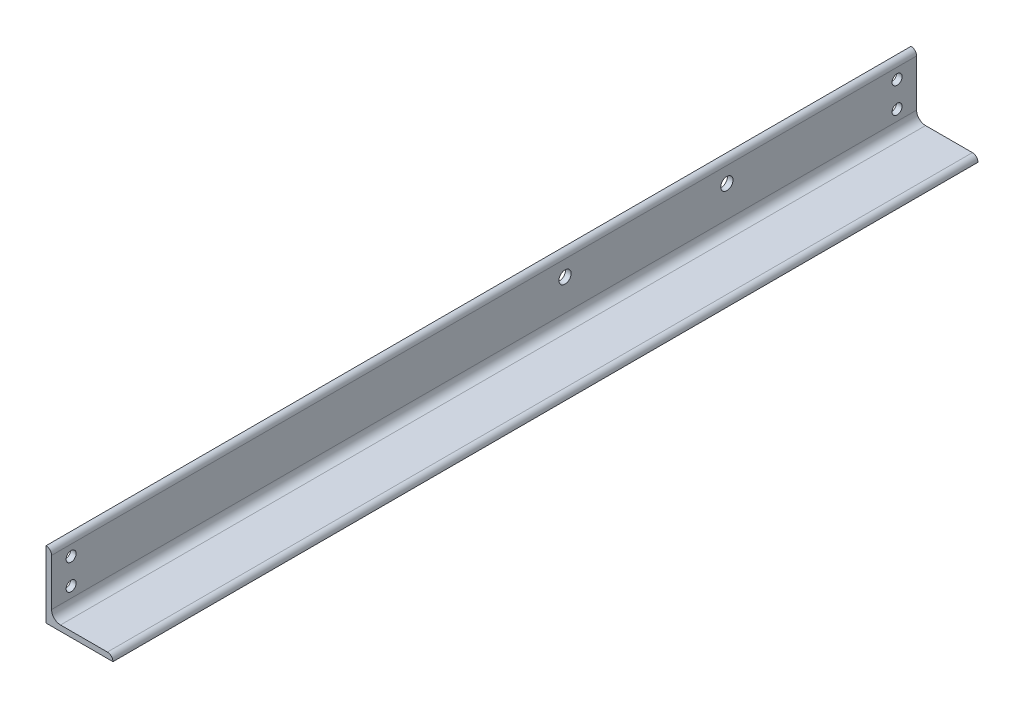
ISO-10303-21;
HEADER;
FILE_DESCRIPTION(('STEP AP214'),'2;1');
FILE_NAME('part.step','',(''),(''),'','','');
FILE_SCHEMA(('AUTOMOTIVE_DESIGN { 1 0 10303 214 1 1 1 1 }'));
ENDSEC;
DATA;
#1=APPLICATION_CONTEXT('core data for automotive mechanical design processes');
#2=APPLICATION_PROTOCOL_DEFINITION('international standard','automotive_design',2000,#1);
#3=PRODUCT_CONTEXT('',#1,'mechanical');
#4=PRODUCT('Part','Part','',(#3));
#5=PRODUCT_RELATED_PRODUCT_CATEGORY('part','',(#4));
#6=PRODUCT_DEFINITION_FORMATION('','',#4);
#7=PRODUCT_DEFINITION_CONTEXT('part definition',#1,'design');
#8=PRODUCT_DEFINITION('design','',#6,#7);
#9=PRODUCT_DEFINITION_SHAPE('','',#8);
#10=(LENGTH_UNIT() NAMED_UNIT(*) SI_UNIT(.MILLI.,.METRE.));
#11=(NAMED_UNIT(*) PLANE_ANGLE_UNIT() SI_UNIT($,.RADIAN.));
#12=(NAMED_UNIT(*) SI_UNIT($,.STERADIAN.) SOLID_ANGLE_UNIT());
#13=UNCERTAINTY_MEASURE_WITH_UNIT(LENGTH_MEASURE(1.E-05),#10,'distance_accuracy_value','');
#14=(GEOMETRIC_REPRESENTATION_CONTEXT(3) GLOBAL_UNCERTAINTY_ASSIGNED_CONTEXT((#13)) GLOBAL_UNIT_ASSIGNED_CONTEXT((#10,
#11,#12)) REPRESENTATION_CONTEXT('',''));
#15=CARTESIAN_POINT('',(0.,0.,0.));
#16=DIRECTION('',(0.,0.,1.));
#17=DIRECTION('',(1.,0.,0.));
#18=AXIS2_PLACEMENT_3D('',#15,#16,#17);
#19=CARTESIAN_POINT('',(59.9999999999999,1.11022302462516E-13,387.5));
#20=DIRECTION('',(0.,1.,0.));
#21=DIRECTION('',(-1.,0.,0.));
#22=AXIS2_PLACEMENT_3D('',#19,#20,#21);
#23=PLANE('',#22);
#24=DIRECTION('',(1.,0.,0.));
#25=VECTOR('',#24,1.);
#26=CARTESIAN_POINT('',(59.9999999999999,1.11022302462516E-13,-387.5));
#27=LINE('',#26,#25);
#28=CARTESIAN_POINT('',(0.,0.,-387.5));
#29=VERTEX_POINT('',#28);
#30=CARTESIAN_POINT('',(59.9999999999999,1.11022302462516E-13,-387.5));
#31=VERTEX_POINT('',#30);
#32=EDGE_CURVE('E116',#29,#31,#27,.T.);
#33=ORIENTED_EDGE('',*,*,#32,.T.);
#34=DIRECTION('',(0.,0.,-1.));
#35=VECTOR('',#34,1.);
#36=CARTESIAN_POINT('',(59.9999999999999,1.11022302462516E-13,387.5));
#37=LINE('',#36,#35);
#38=CARTESIAN_POINT('',(59.9999999999999,1.11022302462516E-13,387.5));
#39=VERTEX_POINT('',#38);
#40=EDGE_CURVE('E114',#39,#31,#37,.T.);
#41=ORIENTED_EDGE('',*,*,#40,.F.);
#42=DIRECTION('',(1.,0.,0.));
#43=VECTOR('',#42,1.);
#44=CARTESIAN_POINT('',(59.9999999999999,1.11022302462516E-13,387.5));
#45=LINE('',#44,#43);
#46=CARTESIAN_POINT('',(0.,0.,387.5));
#47=VERTEX_POINT('',#46);
#48=EDGE_CURVE('E101',#47,#39,#45,.T.);
#49=ORIENTED_EDGE('',*,*,#48,.F.);
#50=DIRECTION('',(0.,0.,-1.));
#51=VECTOR('',#50,1.);
#52=CARTESIAN_POINT('',(0.,0.,387.5));
#53=LINE('',#52,#51);
#54=EDGE_CURVE('E136',#47,#29,#53,.T.);
#55=ORIENTED_EDGE('',*,*,#54,.T.);
#56=EDGE_LOOP('',(#33,#41,#49,#55));
#57=FACE_BOUND('',#56,.T.);
#58=ADVANCED_FACE('F42',(#57),#23,.F.);
#59=CARTESIAN_POINT('',(13.,5.00000000000006,387.5));
#60=DIRECTION('',(0.,-1.,0.));
#61=DIRECTION('',(1.,0.,0.));
#62=AXIS2_PLACEMENT_3D('',#59,#60,#61);
#63=PLANE('',#62);
#64=DIRECTION('',(-1.,0.,0.));
#65=VECTOR('',#64,1.);
#66=CARTESIAN_POINT('',(13.,5.00000000000006,387.5));
#67=LINE('',#66,#65);
#68=CARTESIAN_POINT('',(55.,5.00000000000012,387.5));
#69=VERTEX_POINT('',#68);
#70=CARTESIAN_POINT('',(13.,5.00000000000006,387.5));
#71=VERTEX_POINT('',#70);
#72=EDGE_CURVE('E109',#69,#71,#67,.T.);
#73=ORIENTED_EDGE('',*,*,#72,.F.);
#74=DIRECTION('',(0.,0.,-1.));
#75=VECTOR('',#74,1.);
#76=CARTESIAN_POINT('',(55.,5.00000000000012,387.5));
#77=LINE('',#76,#75);
#78=CARTESIAN_POINT('',(55.,5.00000000000012,-387.5));
#79=VERTEX_POINT('',#78);
#80=EDGE_CURVE('E11',#69,#79,#77,.T.);
#81=ORIENTED_EDGE('',*,*,#80,.T.);
#82=DIRECTION('',(-1.,0.,0.));
#83=VECTOR('',#82,1.);
#84=CARTESIAN_POINT('',(13.,5.00000000000006,-387.5));
#85=LINE('',#84,#83);
#86=CARTESIAN_POINT('',(13.,5.00000000000006,-387.5));
#87=VERTEX_POINT('',#86);
#88=EDGE_CURVE('E143',#79,#87,#85,.T.);
#89=ORIENTED_EDGE('',*,*,#88,.T.);
#90=DIRECTION('',(0.,0.,-1.));
#91=VECTOR('',#90,1.);
#92=CARTESIAN_POINT('',(13.,5.00000000000006,387.5));
#93=LINE('',#92,#91);
#94=EDGE_CURVE('E119',#71,#87,#93,.T.);
#95=ORIENTED_EDGE('',*,*,#94,.F.);
#96=EDGE_LOOP('',(#73,#81,#89,#95));
#97=FACE_BOUND('',#96,.T.);
#98=ADVANCED_FACE('F219',(#97),#63,.F.);
#99=CARTESIAN_POINT('',(13.,13.0000000000001,387.5));
#100=DIRECTION('',(0.,0.,-1.));
#101=DIRECTION('',(-1.,0.,0.));
#102=AXIS2_PLACEMENT_3D('',#99,#100,#101);
#103=CYLINDRICAL_SURFACE('',#102,8.);
#104=CARTESIAN_POINT('',(13.,13.0000000000001,-387.5));
#105=DIRECTION('',(0.,0.,-1.));
#106=DIRECTION('',(-1.,0.,0.));
#107=AXIS2_PLACEMENT_3D('',#104,#105,#106);
#108=CIRCLE('',#107,8.);
#109=CARTESIAN_POINT('',(5.,13.0000000000001,-387.5));
#110=VERTEX_POINT('',#109);
#111=EDGE_CURVE('E141',#87,#110,#108,.T.);
#112=ORIENTED_EDGE('',*,*,#111,.T.);
#113=DIRECTION('',(0.,0.,-1.));
#114=VECTOR('',#113,1.);
#115=CARTESIAN_POINT('',(5.,13.0000000000001,387.5));
#116=LINE('',#115,#114);
#117=CARTESIAN_POINT('',(5.,13.0000000000001,387.5));
#118=VERTEX_POINT('',#117);
#119=EDGE_CURVE('E130',#118,#110,#116,.T.);
#120=ORIENTED_EDGE('',*,*,#119,.F.);
#121=CARTESIAN_POINT('',(13.,13.0000000000001,387.5));
#122=DIRECTION('',(0.,0.,-1.));
#123=DIRECTION('',(-1.,0.,0.));
#124=AXIS2_PLACEMENT_3D('',#121,#122,#123);
#125=CIRCLE('',#124,8.);
#126=EDGE_CURVE('E150',#71,#118,#125,.T.);
#127=ORIENTED_EDGE('',*,*,#126,.F.);
#128=ORIENTED_EDGE('',*,*,#94,.T.);
#129=EDGE_LOOP('',(#112,#120,#127,#128));
#130=FACE_BOUND('',#129,.T.);
#131=ADVANCED_FACE('F195',(#130),#103,.F.);
#132=CARTESIAN_POINT('',(5.,60.0000000000001,387.5));
#133=DIRECTION('',(-1.,0.,0.));
#134=DIRECTION('',(0.,-1.,0.));
#135=AXIS2_PLACEMENT_3D('',#132,#133,#134);
#136=PLANE('',#135);
#137=CARTESIAN_POINT('',(5.,22.5000000000001,370.));
#138=DIRECTION('',(1.,0.,0.));
#139=DIRECTION('',(0.,0.,-1.));
#140=AXIS2_PLACEMENT_3D('',#137,#138,#139);
#141=CIRCLE('',#140,4.5);
#142=CARTESIAN_POINT('',(5.,22.5000000000001,365.5));
#143=VERTEX_POINT('',#142);
#144=EDGE_CURVE('E185',#143,#143,#141,.T.);
#145=ORIENTED_EDGE('',*,*,#144,.F.);
#146=EDGE_LOOP('',(#145));
#147=FACE_BOUND('',#146,.T.);
#148=CARTESIAN_POINT('',(5.,45.5000000000001,370.));
#149=DIRECTION('',(1.,0.,0.));
#150=DIRECTION('',(0.,0.,-1.));
#151=AXIS2_PLACEMENT_3D('',#148,#149,#150);
#152=CIRCLE('',#151,4.5);
#153=CARTESIAN_POINT('',(5.,45.5000000000001,365.5));
#154=VERTEX_POINT('',#153);
#155=EDGE_CURVE('E179',#154,#154,#152,.T.);
#156=ORIENTED_EDGE('',*,*,#155,.F.);
#157=EDGE_LOOP('',(#156));
#158=FACE_BOUND('',#157,.T.);
#159=CARTESIAN_POINT('',(5.,22.5000000000001,-370.));
#160=DIRECTION('',(1.,0.,0.));
#161=DIRECTION('',(0.,0.,-1.));
#162=AXIS2_PLACEMENT_3D('',#159,#160,#161);
#163=CIRCLE('',#162,4.5);
#164=CARTESIAN_POINT('',(5.,22.5000000000001,-374.5));
#165=VERTEX_POINT('',#164);
#166=EDGE_CURVE('E173',#165,#165,#163,.T.);
#167=ORIENTED_EDGE('',*,*,#166,.F.);
#168=EDGE_LOOP('',(#167));
#169=FACE_BOUND('',#168,.T.);
#170=CARTESIAN_POINT('',(5.,45.5000000000001,-370.));
#171=DIRECTION('',(1.,0.,0.));
#172=DIRECTION('',(0.,0.,-1.));
#173=AXIS2_PLACEMENT_3D('',#170,#171,#172);
#174=CIRCLE('',#173,4.5);
#175=CARTESIAN_POINT('',(5.,45.5000000000001,-374.5));
#176=VERTEX_POINT('',#175);
#177=EDGE_CURVE('E167',#176,#176,#174,.T.);
#178=ORIENTED_EDGE('',*,*,#177,.F.);
#179=EDGE_LOOP('',(#178));
#180=FACE_BOUND('',#179,.T.);
#181=CARTESIAN_POINT('',(5.,41.0000000000001,-72.4999999999998));
#182=DIRECTION('',(1.,0.,0.));
#183=DIRECTION('',(0.,0.,-1.));
#184=AXIS2_PLACEMENT_3D('',#181,#182,#183);
#185=CIRCLE('',#184,5.5);
#186=CARTESIAN_POINT('',(5.,41.0000000000001,-77.9999999999998));
#187=VERTEX_POINT('',#186);
#188=EDGE_CURVE('E161',#187,#187,#185,.T.);
#189=ORIENTED_EDGE('',*,*,#188,.F.);
#190=EDGE_LOOP('',(#189));
#191=FACE_BOUND('',#190,.T.);
#192=CARTESIAN_POINT('',(5.,41.0000000000001,-217.5));
#193=DIRECTION('',(1.,0.,0.));
#194=DIRECTION('',(0.,0.,-1.));
#195=AXIS2_PLACEMENT_3D('',#192,#193,#194);
#196=CIRCLE('',#195,5.5);
#197=CARTESIAN_POINT('',(5.,41.0000000000001,-223.));
#198=VERTEX_POINT('',#197);
#199=EDGE_CURVE('E155',#198,#198,#196,.T.);
#200=ORIENTED_EDGE('',*,*,#199,.F.);
#201=EDGE_LOOP('',(#200));
#202=FACE_BOUND('',#201,.T.);
#203=DIRECTION('',(0.,1.,0.));
#204=VECTOR('',#203,1.);
#205=CARTESIAN_POINT('',(5.,60.0000000000001,-387.5));
#206=LINE('',#205,#204);
#207=CARTESIAN_POINT('',(5.,55.0000000000001,-387.5));
#208=VERTEX_POINT('',#207);
#209=EDGE_CURVE('E139',#110,#208,#206,.T.);
#210=ORIENTED_EDGE('',*,*,#209,.T.);
#211=DIRECTION('',(0.,0.,-1.));
#212=VECTOR('',#211,1.);
#213=CARTESIAN_POINT('',(5.,55.0000000000001,387.5));
#214=LINE('',#213,#212);
#215=CARTESIAN_POINT('',(5.,55.0000000000001,387.5));
#216=VERTEX_POINT('',#215);
#217=EDGE_CURVE('E65',#208,#216,#214,.F.);
#218=ORIENTED_EDGE('',*,*,#217,.T.);
#219=DIRECTION('',(0.,1.,0.));
#220=VECTOR('',#219,1.);
#221=CARTESIAN_POINT('',(5.,60.0000000000001,387.5));
#222=LINE('',#221,#220);
#223=EDGE_CURVE('E148',#118,#216,#222,.T.);
#224=ORIENTED_EDGE('',*,*,#223,.F.);
#225=ORIENTED_EDGE('',*,*,#119,.T.);
#226=EDGE_LOOP('',(#210,#218,#224,#225));
#227=FACE_BOUND('',#226,.T.);
#228=ADVANCED_FACE('F191',(#147,#158,#169,#180,#191,#202,#227),#136,.F.);
#229=CARTESIAN_POINT('',(0.,60.0000000000001,387.5));
#230=DIRECTION('',(1.,0.,0.));
#231=DIRECTION('',(0.,1.,0.));
#232=AXIS2_PLACEMENT_3D('',#229,#230,#231);
#233=PLANE('',#232);
#234=CARTESIAN_POINT('',(0.,22.5,370.));
#235=DIRECTION('',(1.,0.,0.));
#236=DIRECTION('',(0.,0.,-1.));
#237=AXIS2_PLACEMENT_3D('',#234,#235,#236);
#238=CIRCLE('',#237,4.5);
#239=CARTESIAN_POINT('',(0.,22.5,365.5));
#240=VERTEX_POINT('',#239);
#241=EDGE_CURVE('E182',#240,#240,#238,.T.);
#242=ORIENTED_EDGE('',*,*,#241,.T.);
#243=EDGE_LOOP('',(#242));
#244=FACE_BOUND('',#243,.T.);
#245=CARTESIAN_POINT('',(0.,45.5000000000001,370.));
#246=DIRECTION('',(1.,0.,0.));
#247=DIRECTION('',(0.,0.,-1.));
#248=AXIS2_PLACEMENT_3D('',#245,#246,#247);
#249=CIRCLE('',#248,4.5);
#250=CARTESIAN_POINT('',(0.,45.5000000000001,365.5));
#251=VERTEX_POINT('',#250);
#252=EDGE_CURVE('E176',#251,#251,#249,.T.);
#253=ORIENTED_EDGE('',*,*,#252,.T.);
#254=EDGE_LOOP('',(#253));
#255=FACE_BOUND('',#254,.T.);
#256=CARTESIAN_POINT('',(0.,22.5,-370.));
#257=DIRECTION('',(1.,0.,0.));
#258=DIRECTION('',(0.,0.,-1.));
#259=AXIS2_PLACEMENT_3D('',#256,#257,#258);
#260=CIRCLE('',#259,4.5);
#261=CARTESIAN_POINT('',(0.,22.5,-374.5));
#262=VERTEX_POINT('',#261);
#263=EDGE_CURVE('E170',#262,#262,#260,.T.);
#264=ORIENTED_EDGE('',*,*,#263,.T.);
#265=EDGE_LOOP('',(#264));
#266=FACE_BOUND('',#265,.T.);
#267=CARTESIAN_POINT('',(0.,45.5000000000001,-370.));
#268=DIRECTION('',(1.,0.,0.));
#269=DIRECTION('',(0.,0.,-1.));
#270=AXIS2_PLACEMENT_3D('',#267,#268,#269);
#271=CIRCLE('',#270,4.5);
#272=CARTESIAN_POINT('',(0.,45.5000000000001,-374.5));
#273=VERTEX_POINT('',#272);
#274=EDGE_CURVE('E164',#273,#273,#271,.T.);
#275=ORIENTED_EDGE('',*,*,#274,.T.);
#276=EDGE_LOOP('',(#275));
#277=FACE_BOUND('',#276,.T.);
#278=CARTESIAN_POINT('',(0.,41.0000000000001,-72.4999999999998));
#279=DIRECTION('',(1.,0.,0.));
#280=DIRECTION('',(0.,0.,-1.));
#281=AXIS2_PLACEMENT_3D('',#278,#279,#280);
#282=CIRCLE('',#281,5.5);
#283=CARTESIAN_POINT('',(0.,41.0000000000001,-77.9999999999998));
#284=VERTEX_POINT('',#283);
#285=EDGE_CURVE('E158',#284,#284,#282,.T.);
#286=ORIENTED_EDGE('',*,*,#285,.T.);
#287=EDGE_LOOP('',(#286));
#288=FACE_BOUND('',#287,.T.);
#289=CARTESIAN_POINT('',(0.,41.0000000000001,-217.5));
#290=DIRECTION('',(1.,0.,0.));
#291=DIRECTION('',(0.,0.,-1.));
#292=AXIS2_PLACEMENT_3D('',#289,#290,#291);
#293=CIRCLE('',#292,5.5);
#294=CARTESIAN_POINT('',(0.,41.0000000000001,-223.));
#295=VERTEX_POINT('',#294);
#296=EDGE_CURVE('E146',#295,#295,#293,.T.);
#297=ORIENTED_EDGE('',*,*,#296,.T.);
#298=EDGE_LOOP('',(#297));
#299=FACE_BOUND('',#298,.T.);
#300=DIRECTION('',(0.,-1.,0.));
#301=VECTOR('',#300,1.);
#302=CARTESIAN_POINT('',(0.,60.0000000000001,-387.5));
#303=LINE('',#302,#301);
#304=CARTESIAN_POINT('',(0.,60.0000000000001,-387.5));
#305=VERTEX_POINT('',#304);
#306=EDGE_CURVE('E110',#305,#29,#303,.T.);
#307=ORIENTED_EDGE('',*,*,#306,.T.);
#308=ORIENTED_EDGE('',*,*,#54,.F.);
#309=DIRECTION('',(0.,-1.,0.));
#310=VECTOR('',#309,1.);
#311=CARTESIAN_POINT('',(0.,60.0000000000001,387.5));
#312=LINE('',#311,#310);
#313=CARTESIAN_POINT('',(0.,60.0000000000001,387.5));
#314=VERTEX_POINT('',#313);
#315=EDGE_CURVE('E105',#314,#47,#312,.T.);
#316=ORIENTED_EDGE('',*,*,#315,.F.);
#317=DIRECTION('',(0.,0.,-1.));
#318=VECTOR('',#317,1.);
#319=CARTESIAN_POINT('',(0.,60.0000000000001,387.5));
#320=LINE('',#319,#318);
#321=EDGE_CURVE('E133',#314,#305,#320,.T.);
#322=ORIENTED_EDGE('',*,*,#321,.T.);
#323=EDGE_LOOP('',(#307,#308,#316,#322));
#324=FACE_BOUND('',#323,.T.);
#325=ADVANCED_FACE('F194',(#244,#255,#266,#277,#288,#299,#324),#233,.F.);
#326=CARTESIAN_POINT('',(13.,13.0000000000001,387.5));
#327=DIRECTION('',(0.,0.,-1.));
#328=DIRECTION('',(-1.,0.,0.));
#329=AXIS2_PLACEMENT_3D('',#326,#327,#328);
#330=PLANE('',#329);
#331=ORIENTED_EDGE('',*,*,#223,.T.);
#332=CARTESIAN_POINT('',(0.,55.0000000000001,387.5));
#333=DIRECTION('',(0.,0.,-1.));
#334=DIRECTION('',(-1.,0.,0.));
#335=AXIS2_PLACEMENT_3D('',#332,#333,#334);
#336=CIRCLE('',#335,5.);
#337=EDGE_CURVE('E50',#216,#314,#336,.F.);
#338=ORIENTED_EDGE('',*,*,#337,.T.);
#339=ORIENTED_EDGE('',*,*,#315,.T.);
#340=ORIENTED_EDGE('',*,*,#48,.T.);
#341=CARTESIAN_POINT('',(55.,1.11022302462516E-13,387.5));
#342=DIRECTION('',(0.,0.,-1.));
#343=DIRECTION('',(-1.,0.,0.));
#344=AXIS2_PLACEMENT_3D('',#341,#342,#343);
#345=CIRCLE('',#344,5.);
#346=EDGE_CURVE('E57',#39,#69,#345,.F.);
#347=ORIENTED_EDGE('',*,*,#346,.T.);
#348=ORIENTED_EDGE('',*,*,#72,.T.);
#349=ORIENTED_EDGE('',*,*,#126,.T.);
#350=EDGE_LOOP('',(#331,#338,#339,#340,#347,#348,#349));
#351=FACE_BOUND('',#350,.T.);
#352=ADVANCED_FACE('F103',(#351),#330,.F.);
#353=CARTESIAN_POINT('',(13.,13.0000000000001,-387.5));
#354=DIRECTION('',(0.,0.,-1.));
#355=DIRECTION('',(-1.,0.,0.));
#356=AXIS2_PLACEMENT_3D('',#353,#354,#355);
#357=PLANE('',#356);
#358=ORIENTED_EDGE('',*,*,#306,.F.);
#359=CARTESIAN_POINT('',(0.,55.0000000000001,-387.5));
#360=DIRECTION('',(0.,0.,-1.));
#361=DIRECTION('',(-1.,0.,0.));
#362=AXIS2_PLACEMENT_3D('',#359,#360,#361);
#363=CIRCLE('',#362,5.);
#364=EDGE_CURVE('E123',#305,#208,#363,.T.);
#365=ORIENTED_EDGE('',*,*,#364,.T.);
#366=ORIENTED_EDGE('',*,*,#209,.F.);
#367=ORIENTED_EDGE('',*,*,#111,.F.);
#368=ORIENTED_EDGE('',*,*,#88,.F.);
#369=CARTESIAN_POINT('',(55.,1.11022302462516E-13,-387.5));
#370=DIRECTION('',(0.,0.,-1.));
#371=DIRECTION('',(-1.,0.,0.));
#372=AXIS2_PLACEMENT_3D('',#369,#370,#371);
#373=CIRCLE('',#372,5.);
#374=EDGE_CURVE('E118',#79,#31,#373,.T.);
#375=ORIENTED_EDGE('',*,*,#374,.T.);
#376=ORIENTED_EDGE('',*,*,#32,.F.);
#377=EDGE_LOOP('',(#358,#365,#366,#367,#368,#375,#376));
#378=FACE_BOUND('',#377,.T.);
#379=ADVANCED_FACE('F216',(#378),#357,.T.);
#380=CARTESIAN_POINT('',(0.,55.0000000000001,387.5));
#381=DIRECTION('',(0.,0.,-1.));
#382=DIRECTION('',(-1.,0.,0.));
#383=AXIS2_PLACEMENT_3D('',#380,#381,#382);
#384=CYLINDRICAL_SURFACE('',#383,5.);
#385=ORIENTED_EDGE('',*,*,#337,.F.);
#386=ORIENTED_EDGE('',*,*,#217,.F.);
#387=ORIENTED_EDGE('',*,*,#364,.F.);
#388=ORIENTED_EDGE('',*,*,#321,.F.);
#389=EDGE_LOOP('',(#385,#386,#387,#388));
#390=FACE_BOUND('',#389,.T.);
#391=ADVANCED_FACE('F212',(#390),#384,.T.);
#392=CARTESIAN_POINT('',(55.,1.11022302462516E-13,387.5));
#393=DIRECTION('',(0.,0.,-1.));
#394=DIRECTION('',(-1.,0.,0.));
#395=AXIS2_PLACEMENT_3D('',#392,#393,#394);
#396=CYLINDRICAL_SURFACE('',#395,5.);
#397=ORIENTED_EDGE('',*,*,#346,.F.);
#398=ORIENTED_EDGE('',*,*,#40,.T.);
#399=ORIENTED_EDGE('',*,*,#374,.F.);
#400=ORIENTED_EDGE('',*,*,#80,.F.);
#401=EDGE_LOOP('',(#397,#398,#399,#400));
#402=FACE_BOUND('',#401,.T.);
#403=ADVANCED_FACE('F44',(#402),#396,.T.);
#404=CARTESIAN_POINT('',(5.,41.0000000000001,-217.5));
#405=DIRECTION('',(1.,0.,0.));
#406=DIRECTION('',(0.,0.,-1.));
#407=AXIS2_PLACEMENT_3D('',#404,#405,#406);
#408=CYLINDRICAL_SURFACE('',#407,5.5);
#409=ORIENTED_EDGE('',*,*,#296,.F.);
#410=EDGE_LOOP('',(#409));
#411=FACE_BOUND('',#410,.T.);
#412=ORIENTED_EDGE('',*,*,#199,.T.);
#413=EDGE_LOOP('',(#412));
#414=FACE_BOUND('',#413,.T.);
#415=ADVANCED_FACE('F238',(#411,#414),#408,.F.);
#416=CARTESIAN_POINT('',(5.,41.0000000000001,-72.4999999999998));
#417=DIRECTION('',(1.,0.,0.));
#418=DIRECTION('',(0.,0.,-1.));
#419=AXIS2_PLACEMENT_3D('',#416,#417,#418);
#420=CYLINDRICAL_SURFACE('',#419,5.5);
#421=ORIENTED_EDGE('',*,*,#285,.F.);
#422=EDGE_LOOP('',(#421));
#423=FACE_BOUND('',#422,.T.);
#424=ORIENTED_EDGE('',*,*,#188,.T.);
#425=EDGE_LOOP('',(#424));
#426=FACE_BOUND('',#425,.T.);
#427=ADVANCED_FACE('F264',(#423,#426),#420,.F.);
#428=CARTESIAN_POINT('',(5.,45.5000000000001,-370.));
#429=DIRECTION('',(1.,0.,0.));
#430=DIRECTION('',(0.,0.,-1.));
#431=AXIS2_PLACEMENT_3D('',#428,#429,#430);
#432=CYLINDRICAL_SURFACE('',#431,4.5);
#433=ORIENTED_EDGE('',*,*,#274,.F.);
#434=EDGE_LOOP('',(#433));
#435=FACE_BOUND('',#434,.T.);
#436=ORIENTED_EDGE('',*,*,#177,.T.);
#437=EDGE_LOOP('',(#436));
#438=FACE_BOUND('',#437,.T.);
#439=ADVANCED_FACE('F268',(#435,#438),#432,.F.);
#440=CARTESIAN_POINT('',(5.,22.5000000000001,-370.));
#441=DIRECTION('',(1.,0.,0.));
#442=DIRECTION('',(0.,0.,-1.));
#443=AXIS2_PLACEMENT_3D('',#440,#441,#442);
#444=CYLINDRICAL_SURFACE('',#443,4.5);
#445=ORIENTED_EDGE('',*,*,#263,.F.);
#446=EDGE_LOOP('',(#445));
#447=FACE_BOUND('',#446,.T.);
#448=ORIENTED_EDGE('',*,*,#166,.T.);
#449=EDGE_LOOP('',(#448));
#450=FACE_BOUND('',#449,.T.);
#451=ADVANCED_FACE('F274',(#447,#450),#444,.F.);
#452=CARTESIAN_POINT('',(5.,45.5000000000001,370.));
#453=DIRECTION('',(1.,0.,0.));
#454=DIRECTION('',(0.,0.,-1.));
#455=AXIS2_PLACEMENT_3D('',#452,#453,#454);
#456=CYLINDRICAL_SURFACE('',#455,4.5);
#457=ORIENTED_EDGE('',*,*,#252,.F.);
#458=EDGE_LOOP('',(#457));
#459=FACE_BOUND('',#458,.T.);
#460=ORIENTED_EDGE('',*,*,#155,.T.);
#461=EDGE_LOOP('',(#460));
#462=FACE_BOUND('',#461,.T.);
#463=ADVANCED_FACE('F278',(#459,#462),#456,.F.);
#464=CARTESIAN_POINT('',(5.,22.5000000000001,370.));
#465=DIRECTION('',(1.,0.,0.));
#466=DIRECTION('',(0.,0.,-1.));
#467=AXIS2_PLACEMENT_3D('',#464,#465,#466);
#468=CYLINDRICAL_SURFACE('',#467,4.5);
#469=ORIENTED_EDGE('',*,*,#241,.F.);
#470=EDGE_LOOP('',(#469));
#471=FACE_BOUND('',#470,.T.);
#472=ORIENTED_EDGE('',*,*,#144,.T.);
#473=EDGE_LOOP('',(#472));
#474=FACE_BOUND('',#473,.T.);
#475=ADVANCED_FACE('F189',(#471,#474),#468,.F.);
#476=CLOSED_SHELL('',(#58,#98,#131,#228,#325,#352,#379,#391,#403,#415,#427,#439,#451,#463,#475));
#477=MANIFOLD_SOLID_BREP('B2',#476);
#478=ADVANCED_BREP_SHAPE_REPRESENTATION('',(#18,#477),#14);
#479=SHAPE_DEFINITION_REPRESENTATION(#9,#478);
ENDSEC;
END-ISO-10303-21;
